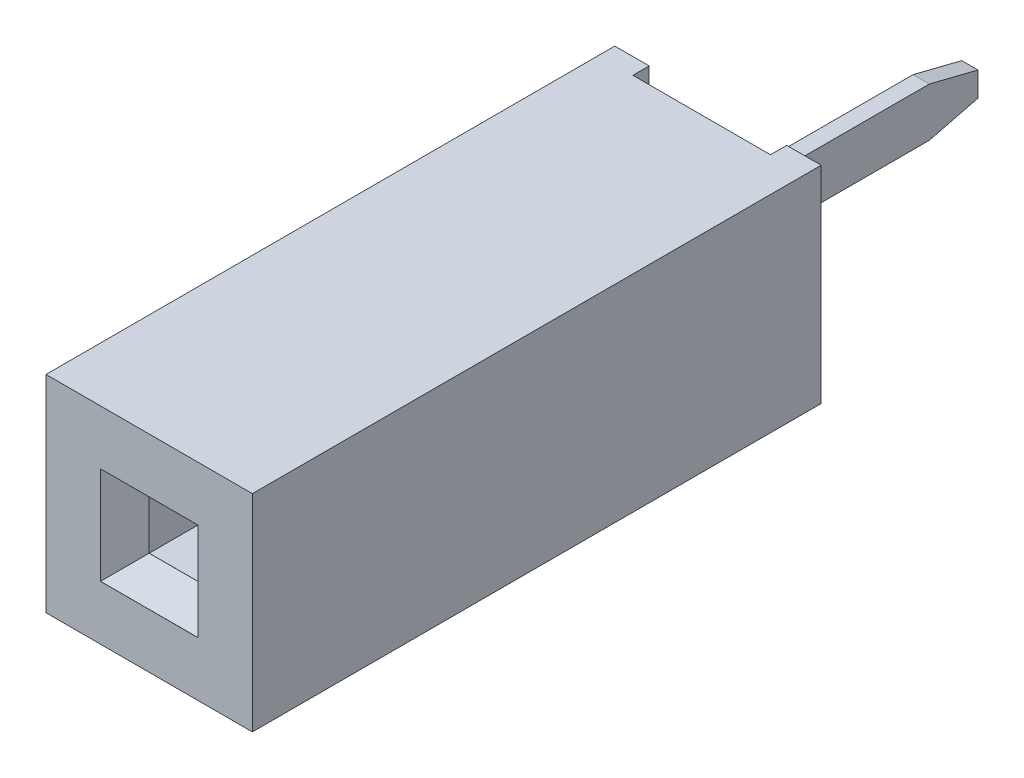
ISO-10303-21;
HEADER;
FILE_DESCRIPTION(('STEP AP214'),'2;1');
FILE_NAME('part.step','',(''),(''),'','','');
FILE_SCHEMA(('AUTOMOTIVE_DESIGN { 1 0 10303 214 1 1 1 1 }'));
ENDSEC;
DATA;
#1=APPLICATION_CONTEXT('core data for automotive mechanical design processes');
#2=APPLICATION_PROTOCOL_DEFINITION('international standard','automotive_design',2000,#1);
#3=PRODUCT_CONTEXT('',#1,'mechanical');
#4=PRODUCT('Part','Part','',(#3));
#5=PRODUCT_RELATED_PRODUCT_CATEGORY('part','',(#4));
#6=PRODUCT_DEFINITION_FORMATION('','',#4);
#7=PRODUCT_DEFINITION_CONTEXT('part definition',#1,'design');
#8=PRODUCT_DEFINITION('design','',#6,#7);
#9=PRODUCT_DEFINITION_SHAPE('','',#8);
#10=(LENGTH_UNIT() NAMED_UNIT(*) SI_UNIT(.MILLI.,.METRE.));
#11=(NAMED_UNIT(*) PLANE_ANGLE_UNIT() SI_UNIT($,.RADIAN.));
#12=(NAMED_UNIT(*) SI_UNIT($,.STERADIAN.) SOLID_ANGLE_UNIT());
#13=UNCERTAINTY_MEASURE_WITH_UNIT(LENGTH_MEASURE(1.E-05),#10,'distance_accuracy_value','');
#14=(GEOMETRIC_REPRESENTATION_CONTEXT(3) GLOBAL_UNCERTAINTY_ASSIGNED_CONTEXT((#13)) GLOBAL_UNIT_ASSIGNED_CONTEXT((#10,
#11,#12)) REPRESENTATION_CONTEXT('',''));
#15=CARTESIAN_POINT('',(0.,0.,0.));
#16=DIRECTION('',(0.,0.,1.));
#17=DIRECTION('',(1.,0.,0.));
#18=AXIS2_PLACEMENT_3D('',#15,#16,#17);
#19=CARTESIAN_POINT('',(-0.1,0.25,1.25));
#20=DIRECTION('',(0.,-1.,0.));
#21=DIRECTION('',(0.,0.,-1.));
#22=AXIS2_PLACEMENT_3D('',#19,#20,#21);
#23=PLANE('',#22);
#24=DIRECTION('',(1.,0.,0.));
#25=VECTOR('',#24,1.);
#26=CARTESIAN_POINT('',(-0.1,0.25,1.25));
#27=LINE('',#26,#25);
#28=CARTESIAN_POINT('',(-0.1,0.25,1.25));
#29=VERTEX_POINT('',#28);
#30=CARTESIAN_POINT('',(0.1,0.25,1.25));
#31=VERTEX_POINT('',#30);
#32=EDGE_CURVE('E11',#29,#31,#27,.T.);
#33=ORIENTED_EDGE('',*,*,#32,.T.);
#34=DIRECTION('',(0.,0.,1.));
#35=VECTOR('',#34,1.);
#36=CARTESIAN_POINT('',(0.1,0.25,1.25));
#37=LINE('',#36,#35);
#38=CARTESIAN_POINT('',(0.1,0.25,5.85));
#39=VERTEX_POINT('',#38);
#40=EDGE_CURVE('E482',#31,#39,#37,.T.);
#41=ORIENTED_EDGE('',*,*,#40,.T.);
#42=DIRECTION('',(1.,0.,0.));
#43=VECTOR('',#42,1.);
#44=CARTESIAN_POINT('',(-0.1,0.25,5.85));
#45=LINE('',#44,#43);
#46=CARTESIAN_POINT('',(-0.1,0.25,5.85));
#47=VERTEX_POINT('',#46);
#48=EDGE_CURVE('E362',#47,#39,#45,.T.);
#49=ORIENTED_EDGE('',*,*,#48,.F.);
#50=DIRECTION('',(0.,0.,1.));
#51=VECTOR('',#50,1.);
#52=CARTESIAN_POINT('',(-0.1,0.25,1.25));
#53=LINE('',#52,#51);
#54=EDGE_CURVE('E553',#29,#47,#53,.T.);
#55=ORIENTED_EDGE('',*,*,#54,.F.);
#56=EDGE_LOOP('',(#33,#41,#49,#55));
#57=FACE_BOUND('',#56,.T.);
#58=ADVANCED_FACE('F16',(#57),#23,.T.);
#59=CARTESIAN_POINT('',(-0.1,-0.25,1.25));
#60=DIRECTION('',(0.,0.,1.));
#61=DIRECTION('',(1.,0.,0.));
#62=AXIS2_PLACEMENT_3D('',#59,#60,#61);
#63=PLANE('',#62);
#64=DIRECTION('',(1.,0.,0.));
#65=VECTOR('',#64,1.);
#66=CARTESIAN_POINT('',(-0.1,-0.25,1.25));
#67=LINE('',#66,#65);
#68=CARTESIAN_POINT('',(-0.1,-0.25,1.25));
#69=VERTEX_POINT('',#68);
#70=CARTESIAN_POINT('',(0.1,-0.25,1.25));
#71=VERTEX_POINT('',#70);
#72=EDGE_CURVE('E27',#69,#71,#67,.T.);
#73=ORIENTED_EDGE('',*,*,#72,.T.);
#74=DIRECTION('',(0.,1.,0.));
#75=VECTOR('',#74,1.);
#76=CARTESIAN_POINT('',(0.1,-0.25,1.25));
#77=LINE('',#76,#75);
#78=EDGE_CURVE('E345',#71,#31,#77,.T.);
#79=ORIENTED_EDGE('',*,*,#78,.T.);
#80=ORIENTED_EDGE('',*,*,#32,.F.);
#81=DIRECTION('',(0.,1.,0.));
#82=VECTOR('',#81,1.);
#83=CARTESIAN_POINT('',(-0.1,-0.25,1.25));
#84=LINE('',#83,#82);
#85=EDGE_CURVE('E556',#69,#29,#84,.T.);
#86=ORIENTED_EDGE('',*,*,#85,.F.);
#87=EDGE_LOOP('',(#73,#79,#80,#86));
#88=FACE_BOUND('',#87,.T.);
#89=ADVANCED_FACE('F651',(#88),#63,.T.);
#90=CARTESIAN_POINT('',(-0.1,-0.25,5.85));
#91=DIRECTION('',(0.,1.,0.));
#92=DIRECTION('',(1.,0.,0.));
#93=AXIS2_PLACEMENT_3D('',#90,#91,#92);
#94=PLANE('',#93);
#95=DIRECTION('',(1.,0.,0.));
#96=VECTOR('',#95,1.);
#97=CARTESIAN_POINT('',(-0.1,-0.25,5.85));
#98=LINE('',#97,#96);
#99=CARTESIAN_POINT('',(-0.1,-0.25,5.85));
#100=VERTEX_POINT('',#99);
#101=CARTESIAN_POINT('',(0.1,-0.25,5.85));
#102=VERTEX_POINT('',#101);
#103=EDGE_CURVE('E480',#100,#102,#98,.T.);
#104=ORIENTED_EDGE('',*,*,#103,.T.);
#105=DIRECTION('',(0.,0.,-1.));
#106=VECTOR('',#105,1.);
#107=CARTESIAN_POINT('',(0.1,-0.25,5.85));
#108=LINE('',#107,#106);
#109=EDGE_CURVE('E341',#102,#71,#108,.T.);
#110=ORIENTED_EDGE('',*,*,#109,.T.);
#111=ORIENTED_EDGE('',*,*,#72,.F.);
#112=DIRECTION('',(0.,0.,-1.));
#113=VECTOR('',#112,1.);
#114=CARTESIAN_POINT('',(-0.1,-0.25,5.85));
#115=LINE('',#114,#113);
#116=EDGE_CURVE('E455',#100,#69,#115,.T.);
#117=ORIENTED_EDGE('',*,*,#116,.F.);
#118=EDGE_LOOP('',(#104,#110,#111,#117));
#119=FACE_BOUND('',#118,.T.);
#120=ADVANCED_FACE('F756',(#119),#94,.T.);
#121=CARTESIAN_POINT('',(-0.1,0.25,5.85));
#122=DIRECTION('',(0.,-0.707106781186548,0.707106781186548));
#123=DIRECTION('',(-1.,0.,0.));
#124=AXIS2_PLACEMENT_3D('',#121,#122,#123);
#125=PLANE('',#124);
#126=ORIENTED_EDGE('',*,*,#48,.T.);
#127=DIRECTION('',(0.,0.707106781186548,0.707106781186548));
#128=VECTOR('',#127,1.);
#129=CARTESIAN_POINT('',(0.1,0.25,5.85));
#130=LINE('',#129,#128);
#131=CARTESIAN_POINT('',(0.1,0.3,5.9));
#132=VERTEX_POINT('',#131);
#133=EDGE_CURVE('E486',#39,#132,#130,.T.);
#134=ORIENTED_EDGE('',*,*,#133,.T.);
#135=DIRECTION('',(1.,0.,0.));
#136=VECTOR('',#135,1.);
#137=CARTESIAN_POINT('',(-0.1,0.3,5.9));
#138=LINE('',#137,#136);
#139=CARTESIAN_POINT('',(-0.1,0.3,5.9));
#140=VERTEX_POINT('',#139);
#141=EDGE_CURVE('E375',#140,#132,#138,.T.);
#142=ORIENTED_EDGE('',*,*,#141,.F.);
#143=DIRECTION('',(0.,0.707106781186548,0.707106781186548));
#144=VECTOR('',#143,1.);
#145=CARTESIAN_POINT('',(-0.1,0.25,5.85));
#146=LINE('',#145,#144);
#147=EDGE_CURVE('E481',#47,#140,#146,.T.);
#148=ORIENTED_EDGE('',*,*,#147,.F.);
#149=EDGE_LOOP('',(#126,#134,#142,#148));
#150=FACE_BOUND('',#149,.T.);
#151=ADVANCED_FACE('F884',(#150),#125,.T.);
#152=CARTESIAN_POINT('',(0.3,-0.3,0.9));
#153=DIRECTION('',(0.,0.,-1.));
#154=DIRECTION('',(0.,-1.,0.));
#155=AXIS2_PLACEMENT_3D('',#152,#153,#154);
#156=PLANE('',#155);
#157=DIRECTION('',(-1.,0.,0.));
#158=VECTOR('',#157,1.);
#159=CARTESIAN_POINT('',(0.3,0.3,0.9));
#160=LINE('',#159,#158);
#161=CARTESIAN_POINT('',(0.3,0.3,0.9));
#162=VERTEX_POINT('',#161);
#163=CARTESIAN_POINT('',(0.1,0.3,0.9));
#164=VERTEX_POINT('',#163);
#165=EDGE_CURVE('E463',#162,#164,#160,.T.);
#166=ORIENTED_EDGE('',*,*,#165,.T.);
#167=DIRECTION('',(0.,1.,0.));
#168=VECTOR('',#167,1.);
#169=CARTESIAN_POINT('',(0.1,-0.3,0.9));
#170=LINE('',#169,#168);
#171=CARTESIAN_POINT('',(0.1,-0.3,0.9));
#172=VERTEX_POINT('',#171);
#173=EDGE_CURVE('E344',#172,#164,#170,.T.);
#174=ORIENTED_EDGE('',*,*,#173,.F.);
#175=DIRECTION('',(1.,0.,0.));
#176=VECTOR('',#175,1.);
#177=CARTESIAN_POINT('',(-0.3,-0.3,0.9));
#178=LINE('',#177,#176);
#179=CARTESIAN_POINT('',(0.3,-0.3,0.9));
#180=VERTEX_POINT('',#179);
#181=EDGE_CURVE('E314',#172,#180,#178,.T.);
#182=ORIENTED_EDGE('',*,*,#181,.T.);
#183=DIRECTION('',(0.,1.,0.));
#184=VECTOR('',#183,1.);
#185=CARTESIAN_POINT('',(0.3,-0.3,0.9));
#186=LINE('',#185,#184);
#187=EDGE_CURVE('E401',#180,#162,#186,.T.);
#188=ORIENTED_EDGE('',*,*,#187,.T.);
#189=EDGE_LOOP('',(#166,#174,#182,#188));
#190=FACE_BOUND('',#189,.T.);
#191=ADVANCED_FACE('F712',(#190),#156,.F.);
#192=CARTESIAN_POINT('',(0.1,0.3,0.2));
#193=DIRECTION('',(-1.,0.,0.));
#194=DIRECTION('',(0.,1.,0.));
#195=AXIS2_PLACEMENT_3D('',#192,#193,#194);
#196=PLANE('',#195);
#197=ORIENTED_EDGE('',*,*,#133,.F.);
#198=ORIENTED_EDGE('',*,*,#40,.F.);
#199=ORIENTED_EDGE('',*,*,#78,.F.);
#200=ORIENTED_EDGE('',*,*,#109,.F.);
#201=DIRECTION('',(0.,0.707106781186548,-0.707106781186548));
#202=VECTOR('',#201,1.);
#203=CARTESIAN_POINT('',(0.1,-0.3,5.9));
#204=LINE('',#203,#202);
#205=CARTESIAN_POINT('',(0.1,-0.3,5.9));
#206=VERTEX_POINT('',#205);
#207=EDGE_CURVE('E476',#206,#102,#204,.T.);
#208=ORIENTED_EDGE('',*,*,#207,.F.);
#209=DIRECTION('',(0.,0.,1.));
#210=VECTOR('',#209,1.);
#211=CARTESIAN_POINT('',(0.1,-0.3,3.45));
#212=LINE('',#211,#210);
#213=EDGE_CURVE('E493',#172,#206,#212,.T.);
#214=ORIENTED_EDGE('',*,*,#213,.F.);
#215=ORIENTED_EDGE('',*,*,#173,.T.);
#216=DIRECTION('',(0.,0.,-1.));
#217=VECTOR('',#216,1.);
#218=CARTESIAN_POINT('',(0.1,0.3,3.45));
#219=LINE('',#218,#217);
#220=EDGE_CURVE('E459',#132,#164,#219,.T.);
#221=ORIENTED_EDGE('',*,*,#220,.F.);
#222=EDGE_LOOP('',(#197,#198,#199,#200,#208,#214,#215,#221));
#223=FACE_BOUND('',#222,.T.);
#224=ADVANCED_FACE('F656',(#223),#196,.F.);
#225=CARTESIAN_POINT('',(-0.1,-0.3,5.9));
#226=DIRECTION('',(0.,0.707106781186548,0.707106781186548));
#227=DIRECTION('',(1.,0.,0.));
#228=AXIS2_PLACEMENT_3D('',#225,#226,#227);
#229=PLANE('',#228);
#230=DIRECTION('',(1.,0.,0.));
#231=VECTOR('',#230,1.);
#232=CARTESIAN_POINT('',(-0.1,-0.3,5.9));
#233=LINE('',#232,#231);
#234=CARTESIAN_POINT('',(-0.1,-0.3,5.9));
#235=VERTEX_POINT('',#234);
#236=EDGE_CURVE('E475',#235,#206,#233,.T.);
#237=ORIENTED_EDGE('',*,*,#236,.T.);
#238=ORIENTED_EDGE('',*,*,#207,.T.);
#239=ORIENTED_EDGE('',*,*,#103,.F.);
#240=DIRECTION('',(0.,0.707106781186548,-0.707106781186548));
#241=VECTOR('',#240,1.);
#242=CARTESIAN_POINT('',(-0.1,-0.3,5.9));
#243=LINE('',#242,#241);
#244=EDGE_CURVE('E400',#235,#100,#243,.T.);
#245=ORIENTED_EDGE('',*,*,#244,.F.);
#246=EDGE_LOOP('',(#237,#238,#239,#245));
#247=FACE_BOUND('',#246,.T.);
#248=ADVANCED_FACE('F753',(#247),#229,.T.);
#249=CARTESIAN_POINT('',(-0.1,0.3,0.2));
#250=DIRECTION('',(1.,0.,0.));
#251=DIRECTION('',(0.,1.,0.));
#252=AXIS2_PLACEMENT_3D('',#249,#250,#251);
#253=PLANE('',#252);
#254=DIRECTION('',(0.,0.,-1.));
#255=VECTOR('',#254,1.);
#256=CARTESIAN_POINT('',(-0.1,-0.3,3.45));
#257=LINE('',#256,#255);
#258=CARTESIAN_POINT('',(-0.1,-0.3,0.9));
#259=VERTEX_POINT('',#258);
#260=EDGE_CURVE('E470',#235,#259,#257,.T.);
#261=ORIENTED_EDGE('',*,*,#260,.F.);
#262=ORIENTED_EDGE('',*,*,#244,.T.);
#263=ORIENTED_EDGE('',*,*,#116,.T.);
#264=ORIENTED_EDGE('',*,*,#85,.T.);
#265=ORIENTED_EDGE('',*,*,#54,.T.);
#266=ORIENTED_EDGE('',*,*,#147,.T.);
#267=DIRECTION('',(0.,0.,1.));
#268=VECTOR('',#267,1.);
#269=CARTESIAN_POINT('',(-0.1,0.3,3.45));
#270=LINE('',#269,#268);
#271=CARTESIAN_POINT('',(-0.1,0.3,0.9));
#272=VERTEX_POINT('',#271);
#273=EDGE_CURVE('E371',#272,#140,#270,.T.);
#274=ORIENTED_EDGE('',*,*,#273,.F.);
#275=DIRECTION('',(0.,-1.,0.));
#276=VECTOR('',#275,1.);
#277=CARTESIAN_POINT('',(-0.1,0.3,0.9));
#278=LINE('',#277,#276);
#279=EDGE_CURVE('E397',#272,#259,#278,.T.);
#280=ORIENTED_EDGE('',*,*,#279,.T.);
#281=EDGE_LOOP('',(#261,#262,#263,#264,#265,#266,#274,#280));
#282=FACE_BOUND('',#281,.T.);
#283=ADVANCED_FACE('F743',(#282),#253,.F.);
#284=CARTESIAN_POINT('',(0.3,-0.3,0.9));
#285=DIRECTION('',(0.,0.,-1.));
#286=DIRECTION('',(0.,-1.,0.));
#287=AXIS2_PLACEMENT_3D('',#284,#285,#286);
#288=PLANE('',#287);
#289=DIRECTION('',(-1.,0.,0.));
#290=VECTOR('',#289,1.);
#291=CARTESIAN_POINT('',(0.3,0.3,0.9));
#292=LINE('',#291,#290);
#293=CARTESIAN_POINT('',(-0.3,0.3,0.9));
#294=VERTEX_POINT('',#293);
#295=EDGE_CURVE('E376',#272,#294,#292,.T.);
#296=ORIENTED_EDGE('',*,*,#295,.T.);
#297=DIRECTION('',(0.,-1.,0.));
#298=VECTOR('',#297,1.);
#299=CARTESIAN_POINT('',(-0.3,0.3,0.9));
#300=LINE('',#299,#298);
#301=CARTESIAN_POINT('',(-0.3,-0.3,0.9));
#302=VERTEX_POINT('',#301);
#303=EDGE_CURVE('E505',#294,#302,#300,.T.);
#304=ORIENTED_EDGE('',*,*,#303,.T.);
#305=DIRECTION('',(1.,0.,0.));
#306=VECTOR('',#305,1.);
#307=CARTESIAN_POINT('',(-0.3,-0.3,0.9));
#308=LINE('',#307,#306);
#309=EDGE_CURVE('E474',#302,#259,#308,.T.);
#310=ORIENTED_EDGE('',*,*,#309,.T.);
#311=ORIENTED_EDGE('',*,*,#279,.F.);
#312=EDGE_LOOP('',(#296,#304,#310,#311));
#313=FACE_BOUND('',#312,.T.);
#314=ADVANCED_FACE('F739',(#313),#288,.F.);
#315=CARTESIAN_POINT('',(0.3,-0.3,6.7));
#316=DIRECTION('',(1.,0.,0.));
#317=DIRECTION('',(0.,1.,0.));
#318=AXIS2_PLACEMENT_3D('',#315,#316,#317);
#319=PLANE('',#318);
#320=DIRECTION('',(0.,1.,0.));
#321=VECTOR('',#320,1.);
#322=CARTESIAN_POINT('',(0.3,-0.3,6.7));
#323=LINE('',#322,#321);
#324=CARTESIAN_POINT('',(0.3,-0.3,6.7));
#325=VERTEX_POINT('',#324);
#326=CARTESIAN_POINT('',(0.3,0.3,6.7));
#327=VERTEX_POINT('',#326);
#328=EDGE_CURVE('E395',#325,#327,#323,.T.);
#329=ORIENTED_EDGE('',*,*,#328,.T.);
#330=DIRECTION('',(0.,0.,-1.));
#331=VECTOR('',#330,1.);
#332=CARTESIAN_POINT('',(0.3,0.3,6.7));
#333=LINE('',#332,#331);
#334=EDGE_CURVE('E428',#327,#162,#333,.T.);
#335=ORIENTED_EDGE('',*,*,#334,.T.);
#336=ORIENTED_EDGE('',*,*,#187,.F.);
#337=DIRECTION('',(0.,0.,-1.));
#338=VECTOR('',#337,1.);
#339=CARTESIAN_POINT('',(0.3,-0.3,6.7));
#340=LINE('',#339,#338);
#341=EDGE_CURVE('E310',#325,#180,#340,.T.);
#342=ORIENTED_EDGE('',*,*,#341,.F.);
#343=EDGE_LOOP('',(#329,#335,#336,#342));
#344=FACE_BOUND('',#343,.T.);
#345=ADVANCED_FACE('F707',(#344),#319,.F.);
#346=CARTESIAN_POINT('',(0.3,0.3,6.7));
#347=DIRECTION('',(0.,-1.,0.));
#348=DIRECTION('',(0.,0.,-1.));
#349=AXIS2_PLACEMENT_3D('',#346,#347,#348);
#350=PLANE('',#349);
#351=ORIENTED_EDGE('',*,*,#334,.F.);
#352=DIRECTION('',(-1.,0.,0.));
#353=VECTOR('',#352,1.);
#354=CARTESIAN_POINT('',(0.3,0.3,6.7));
#355=LINE('',#354,#353);
#356=CARTESIAN_POINT('',(-0.3,0.3,6.7));
#357=VERTEX_POINT('',#356);
#358=EDGE_CURVE('E391',#327,#357,#355,.T.);
#359=ORIENTED_EDGE('',*,*,#358,.T.);
#360=DIRECTION('',(0.,0.,-1.));
#361=VECTOR('',#360,1.);
#362=CARTESIAN_POINT('',(-0.3,0.3,6.7));
#363=LINE('',#362,#361);
#364=EDGE_CURVE('E513',#357,#294,#363,.T.);
#365=ORIENTED_EDGE('',*,*,#364,.T.);
#366=ORIENTED_EDGE('',*,*,#295,.F.);
#367=ORIENTED_EDGE('',*,*,#273,.T.);
#368=ORIENTED_EDGE('',*,*,#141,.T.);
#369=ORIENTED_EDGE('',*,*,#220,.T.);
#370=ORIENTED_EDGE('',*,*,#165,.F.);
#371=EDGE_LOOP('',(#351,#359,#365,#366,#367,#368,#369,#370));
#372=FACE_BOUND('',#371,.T.);
#373=ADVANCED_FACE('F745',(#372),#350,.T.);
#374=CARTESIAN_POINT('',(-0.3,0.3,6.7));
#375=DIRECTION('',(-1.,0.,0.));
#376=DIRECTION('',(0.,1.,0.));
#377=AXIS2_PLACEMENT_3D('',#374,#375,#376);
#378=PLANE('',#377);
#379=DIRECTION('',(0.,-1.,0.));
#380=VECTOR('',#379,1.);
#381=CARTESIAN_POINT('',(-0.3,0.3,6.7));
#382=LINE('',#381,#380);
#383=CARTESIAN_POINT('',(-0.3,-0.3,6.7));
#384=VERTEX_POINT('',#383);
#385=EDGE_CURVE('E396',#357,#384,#382,.T.);
#386=ORIENTED_EDGE('',*,*,#385,.T.);
#387=DIRECTION('',(0.,0.,-1.));
#388=VECTOR('',#387,1.);
#389=CARTESIAN_POINT('',(-0.3,-0.3,6.7));
#390=LINE('',#389,#388);
#391=EDGE_CURVE('E315',#384,#302,#390,.T.);
#392=ORIENTED_EDGE('',*,*,#391,.T.);
#393=ORIENTED_EDGE('',*,*,#303,.F.);
#394=ORIENTED_EDGE('',*,*,#364,.F.);
#395=EDGE_LOOP('',(#386,#392,#393,#394));
#396=FACE_BOUND('',#395,.T.);
#397=ADVANCED_FACE('F748',(#396),#378,.F.);
#398=CARTESIAN_POINT('',(-0.3,-0.3,6.7));
#399=DIRECTION('',(0.,1.,0.));
#400=DIRECTION('',(1.,0.,0.));
#401=AXIS2_PLACEMENT_3D('',#398,#399,#400);
#402=PLANE('',#401);
#403=ORIENTED_EDGE('',*,*,#391,.F.);
#404=DIRECTION('',(1.,0.,0.));
#405=VECTOR('',#404,1.);
#406=CARTESIAN_POINT('',(-0.3,-0.3,6.7));
#407=LINE('',#406,#405);
#408=EDGE_CURVE('E502',#384,#325,#407,.T.);
#409=ORIENTED_EDGE('',*,*,#408,.T.);
#410=ORIENTED_EDGE('',*,*,#341,.T.);
#411=ORIENTED_EDGE('',*,*,#181,.F.);
#412=ORIENTED_EDGE('',*,*,#213,.T.);
#413=ORIENTED_EDGE('',*,*,#236,.F.);
#414=ORIENTED_EDGE('',*,*,#260,.T.);
#415=ORIENTED_EDGE('',*,*,#309,.F.);
#416=EDGE_LOOP('',(#403,#409,#410,#411,#412,#413,#414,#415));
#417=FACE_BOUND('',#416,.T.);
#418=ADVANCED_FACE('F715',(#417),#402,.T.);
#419=CARTESIAN_POINT('',(0.6,-0.6,6.7));
#420=DIRECTION('',(0.,0.,-1.));
#421=DIRECTION('',(0.,-1.,0.));
#422=AXIS2_PLACEMENT_3D('',#419,#420,#421);
#423=PLANE('',#422);
#424=ORIENTED_EDGE('',*,*,#385,.F.);
#425=ORIENTED_EDGE('',*,*,#358,.F.);
#426=ORIENTED_EDGE('',*,*,#328,.F.);
#427=ORIENTED_EDGE('',*,*,#408,.F.);
#428=EDGE_LOOP('',(#424,#425,#426,#427));
#429=FACE_BOUND('',#428,.T.);
#430=DIRECTION('',(-1.,0.,0.));
#431=VECTOR('',#430,1.);
#432=CARTESIAN_POINT('',(0.6,0.301,6.7));
#433=LINE('',#432,#431);
#434=CARTESIAN_POINT('',(0.301,0.301,6.7));
#435=VERTEX_POINT('',#434);
#436=CARTESIAN_POINT('',(-0.301,0.301,6.7));
#437=VERTEX_POINT('',#436);
#438=EDGE_CURVE('E382',#435,#437,#433,.T.);
#439=ORIENTED_EDGE('',*,*,#438,.T.);
#440=DIRECTION('',(0.,-1.,0.));
#441=VECTOR('',#440,1.);
#442=CARTESIAN_POINT('',(-0.301,0.6,6.7));
#443=LINE('',#442,#441);
#444=CARTESIAN_POINT('',(-0.301,-0.301,6.7));
#445=VERTEX_POINT('',#444);
#446=EDGE_CURVE('E326',#437,#445,#443,.T.);
#447=ORIENTED_EDGE('',*,*,#446,.T.);
#448=DIRECTION('',(1.,0.,0.));
#449=VECTOR('',#448,1.);
#450=CARTESIAN_POINT('',(-0.6,-0.301,6.7));
#451=LINE('',#450,#449);
#452=CARTESIAN_POINT('',(0.301,-0.301,6.7));
#453=VERTEX_POINT('',#452);
#454=EDGE_CURVE('E282',#445,#453,#451,.T.);
#455=ORIENTED_EDGE('',*,*,#454,.T.);
#456=DIRECTION('',(0.,1.,0.));
#457=VECTOR('',#456,1.);
#458=CARTESIAN_POINT('',(0.301,-0.6,6.7));
#459=LINE('',#458,#457);
#460=EDGE_CURVE('E381',#453,#435,#459,.T.);
#461=ORIENTED_EDGE('',*,*,#460,.T.);
#462=EDGE_LOOP('',(#439,#447,#455,#461));
#463=FACE_BOUND('',#462,.T.);
#464=ADVANCED_FACE('F722',(#429,#463),#423,.F.);
#465=CARTESIAN_POINT('',(-0.1,0.3,-2.5));
#466=DIRECTION('',(0.,0.970142500145391,-0.242535625036098));
#467=DIRECTION('',(-1.,0.,0.));
#468=AXIS2_PLACEMENT_3D('',#465,#466,#467);
#469=PLANE('',#468);
#470=DIRECTION('',(1.,0.,0.));
#471=VECTOR('',#470,1.);
#472=CARTESIAN_POINT('',(-0.1,0.3,-2.5));
#473=LINE('',#472,#471);
#474=CARTESIAN_POINT('',(-0.1,0.3,-2.5));
#475=VERTEX_POINT('',#474);
#476=CARTESIAN_POINT('',(0.1,0.3,-2.5));
#477=VERTEX_POINT('',#476);
#478=EDGE_CURVE('E329',#475,#477,#473,.T.);
#479=ORIENTED_EDGE('',*,*,#478,.T.);
#480=DIRECTION('',(0.,-0.242535625036098,-0.970142500145391));
#481=VECTOR('',#480,1.);
#482=CARTESIAN_POINT('',(0.1,0.3,-2.5));
#483=LINE('',#482,#481);
#484=CARTESIAN_POINT('',(0.1,0.15,-3.1));
#485=VERTEX_POINT('',#484);
#486=EDGE_CURVE('E406',#477,#485,#483,.T.);
#487=ORIENTED_EDGE('',*,*,#486,.T.);
#488=DIRECTION('',(1.,0.,0.));
#489=VECTOR('',#488,1.);
#490=CARTESIAN_POINT('',(-0.1,0.15,-3.1));
#491=LINE('',#490,#489);
#492=CARTESIAN_POINT('',(-0.1,0.15,-3.1));
#493=VERTEX_POINT('',#492);
#494=EDGE_CURVE('E560',#493,#485,#491,.T.);
#495=ORIENTED_EDGE('',*,*,#494,.F.);
#496=DIRECTION('',(0.,-0.242535625036098,-0.970142500145391));
#497=VECTOR('',#496,1.);
#498=CARTESIAN_POINT('',(-0.1,0.3,-2.5));
#499=LINE('',#498,#497);
#500=EDGE_CURVE('E316',#475,#493,#499,.T.);
#501=ORIENTED_EDGE('',*,*,#500,.F.);
#502=EDGE_LOOP('',(#479,#487,#495,#501));
#503=FACE_BOUND('',#502,.T.);
#504=ADVANCED_FACE('F847',(#503),#469,.T.);
#505=CARTESIAN_POINT('',(-0.1,0.15,-3.1));
#506=DIRECTION('',(0.,0.,1.));
#507=DIRECTION('',(1.,0.,0.));
#508=AXIS2_PLACEMENT_3D('',#505,#506,#507);
#509=PLANE('',#508);
#510=ORIENTED_EDGE('',*,*,#494,.T.);
#511=DIRECTION('',(0.,-1.,0.));
#512=VECTOR('',#511,1.);
#513=CARTESIAN_POINT('',(0.1,0.,-3.1));
#514=LINE('',#513,#512);
#515=CARTESIAN_POINT('',(0.1,-0.15,-3.1));
#516=VERTEX_POINT('',#515);
#517=EDGE_CURVE('E411',#485,#516,#514,.T.);
#518=ORIENTED_EDGE('',*,*,#517,.T.);
#519=DIRECTION('',(1.,0.,0.));
#520=VECTOR('',#519,1.);
#521=CARTESIAN_POINT('',(-0.1,-0.15,-3.1));
#522=LINE('',#521,#520);
#523=CARTESIAN_POINT('',(-0.1,-0.15,-3.1));
#524=VERTEX_POINT('',#523);
#525=EDGE_CURVE('E436',#524,#516,#522,.T.);
#526=ORIENTED_EDGE('',*,*,#525,.F.);
#527=DIRECTION('',(0.,-1.,0.));
#528=VECTOR('',#527,1.);
#529=CARTESIAN_POINT('',(-0.1,0.15,-3.1));
#530=LINE('',#529,#528);
#531=EDGE_CURVE('E320',#493,#524,#530,.T.);
#532=ORIENTED_EDGE('',*,*,#531,.F.);
#533=EDGE_LOOP('',(#510,#518,#526,#532));
#534=FACE_BOUND('',#533,.T.);
#535=ADVANCED_FACE('F844',(#534),#509,.F.);
#536=CARTESIAN_POINT('',(-0.1,-0.15,-3.1));
#537=DIRECTION('',(0.,-0.970142500145391,-0.242535625036098));
#538=DIRECTION('',(0.,0.242535625036098,-0.970142500145391));
#539=AXIS2_PLACEMENT_3D('',#536,#537,#538);
#540=PLANE('',#539);
#541=ORIENTED_EDGE('',*,*,#525,.T.);
#542=DIRECTION('',(0.,-0.242535625036098,0.970142500145391));
#543=VECTOR('',#542,1.);
#544=CARTESIAN_POINT('',(0.1,-0.15,-3.1));
#545=LINE('',#544,#543);
#546=CARTESIAN_POINT('',(0.1,-0.3,-2.5));
#547=VERTEX_POINT('',#546);
#548=EDGE_CURVE('E593',#516,#547,#545,.T.);
#549=ORIENTED_EDGE('',*,*,#548,.T.);
#550=DIRECTION('',(1.,0.,0.));
#551=VECTOR('',#550,1.);
#552=CARTESIAN_POINT('',(-0.1,-0.3,-2.5));
#553=LINE('',#552,#551);
#554=CARTESIAN_POINT('',(-0.1,-0.3,-2.5));
#555=VERTEX_POINT('',#554);
#556=EDGE_CURVE('E434',#555,#547,#553,.T.);
#557=ORIENTED_EDGE('',*,*,#556,.F.);
#558=DIRECTION('',(0.,-0.242535625036098,0.970142500145391));
#559=VECTOR('',#558,1.);
#560=CARTESIAN_POINT('',(-0.1,-0.15,-3.1));
#561=LINE('',#560,#559);
#562=EDGE_CURVE('E20',#524,#555,#561,.T.);
#563=ORIENTED_EDGE('',*,*,#562,.F.);
#564=EDGE_LOOP('',(#541,#549,#557,#563));
#565=FACE_BOUND('',#564,.T.);
#566=ADVANCED_FACE('F18',(#565),#540,.T.);
#567=CARTESIAN_POINT('',(-0.1,-0.3,-2.5));
#568=DIRECTION('',(0.,-1.,0.));
#569=DIRECTION('',(0.,0.,-1.));
#570=AXIS2_PLACEMENT_3D('',#567,#568,#569);
#571=PLANE('',#570);
#572=ORIENTED_EDGE('',*,*,#556,.T.);
#573=DIRECTION('',(0.,0.,1.));
#574=VECTOR('',#573,1.);
#575=CARTESIAN_POINT('',(0.1,-0.3,-2.5));
#576=LINE('',#575,#574);
#577=CARTESIAN_POINT('',(0.1,-0.3,0.2));
#578=VERTEX_POINT('',#577);
#579=EDGE_CURVE('E296',#547,#578,#576,.T.);
#580=ORIENTED_EDGE('',*,*,#579,.T.);
#581=DIRECTION('',(1.,0.,0.));
#582=VECTOR('',#581,1.);
#583=CARTESIAN_POINT('',(-0.1,-0.3,0.2));
#584=LINE('',#583,#582);
#585=CARTESIAN_POINT('',(-0.1,-0.3,0.2));
#586=VERTEX_POINT('',#585);
#587=EDGE_CURVE('E321',#586,#578,#584,.T.);
#588=ORIENTED_EDGE('',*,*,#587,.F.);
#589=DIRECTION('',(0.,0.,1.));
#590=VECTOR('',#589,1.);
#591=CARTESIAN_POINT('',(-0.1,-0.3,-2.5));
#592=LINE('',#591,#590);
#593=EDGE_CURVE('E439',#555,#586,#592,.T.);
#594=ORIENTED_EDGE('',*,*,#593,.F.);
#595=EDGE_LOOP('',(#572,#580,#588,#594));
#596=FACE_BOUND('',#595,.T.);
#597=ADVANCED_FACE('F857',(#596),#571,.T.);
#598=CARTESIAN_POINT('',(-0.1,0.3,0.2));
#599=DIRECTION('',(0.,1.,0.));
#600=DIRECTION('',(1.,0.,0.));
#601=AXIS2_PLACEMENT_3D('',#598,#599,#600);
#602=PLANE('',#601);
#603=DIRECTION('',(1.,0.,0.));
#604=VECTOR('',#603,1.);
#605=CARTESIAN_POINT('',(-0.1,0.3,0.2));
#606=LINE('',#605,#604);
#607=CARTESIAN_POINT('',(-0.1,0.3,0.2));
#608=VERTEX_POINT('',#607);
#609=CARTESIAN_POINT('',(0.1,0.3,0.2));
#610=VERTEX_POINT('',#609);
#611=EDGE_CURVE('E292',#608,#610,#606,.T.);
#612=ORIENTED_EDGE('',*,*,#611,.T.);
#613=DIRECTION('',(0.,0.,-1.));
#614=VECTOR('',#613,1.);
#615=CARTESIAN_POINT('',(0.1,0.3,0.2));
#616=LINE('',#615,#614);
#617=EDGE_CURVE('E410',#610,#477,#616,.T.);
#618=ORIENTED_EDGE('',*,*,#617,.T.);
#619=ORIENTED_EDGE('',*,*,#478,.F.);
#620=DIRECTION('',(0.,0.,-1.));
#621=VECTOR('',#620,1.);
#622=CARTESIAN_POINT('',(-0.1,0.3,0.2));
#623=LINE('',#622,#621);
#624=EDGE_CURVE('E303',#608,#475,#623,.T.);
#625=ORIENTED_EDGE('',*,*,#624,.F.);
#626=EDGE_LOOP('',(#612,#618,#619,#625));
#627=FACE_BOUND('',#626,.T.);
#628=ADVANCED_FACE('F860',(#627),#602,.T.);
#629=CARTESIAN_POINT('',(-0.4505,0.6,6.8495));
#630=DIRECTION('',(-0.707106781186548,0.,-0.707106781186548));
#631=DIRECTION('',(-0.707106781186548,0.,0.707106781186548));
#632=AXIS2_PLACEMENT_3D('',#629,#630,#631);
#633=PLANE('',#632);
#634=DIRECTION('',(0.577350269189626,-0.577350269189626,-0.577350269189626));
#635=VECTOR('',#634,1.);
#636=CARTESIAN_POINT('',(-0.300333333333,0.300333333333,6.699333333333));
#637=LINE('',#636,#635);
#638=CARTESIAN_POINT('',(-0.6,0.6,6.999));
#639=VERTEX_POINT('',#638);
#640=EDGE_CURVE('E302',#639,#437,#637,.T.);
#641=ORIENTED_EDGE('',*,*,#640,.F.);
#642=DIRECTION('',(0.,-1.,0.));
#643=VECTOR('',#642,1.);
#644=CARTESIAN_POINT('',(-0.6,0.6,6.999));
#645=LINE('',#644,#643);
#646=CARTESIAN_POINT('',(-0.6,-0.6,6.999));
#647=VERTEX_POINT('',#646);
#648=EDGE_CURVE('E297',#639,#647,#645,.T.);
#649=ORIENTED_EDGE('',*,*,#648,.T.);
#650=DIRECTION('',(0.577350269189626,0.577350269189626,-0.577350269189626));
#651=VECTOR('',#650,1.);
#652=CARTESIAN_POINT('',(-0.300333333333,-0.300333333333,6.699333333333));
#653=LINE('',#652,#651);
#654=EDGE_CURVE('E521',#647,#445,#653,.T.);
#655=ORIENTED_EDGE('',*,*,#654,.T.);
#656=ORIENTED_EDGE('',*,*,#446,.F.);
#657=EDGE_LOOP('',(#641,#649,#655,#656));
#658=FACE_BOUND('',#657,.T.);
#659=ADVANCED_FACE('F771',(#658),#633,.F.);
#660=CARTESIAN_POINT('',(-0.6,-0.4505,6.8495));
#661=DIRECTION('',(0.,-0.707106781186548,-0.707106781186548));
#662=DIRECTION('',(0.,-0.707106781186548,0.707106781186548));
#663=AXIS2_PLACEMENT_3D('',#660,#661,#662);
#664=PLANE('',#663);
#665=ORIENTED_EDGE('',*,*,#654,.F.);
#666=DIRECTION('',(1.,0.,0.));
#667=VECTOR('',#666,1.);
#668=CARTESIAN_POINT('',(-0.6,-0.6,6.999));
#669=LINE('',#668,#667);
#670=CARTESIAN_POINT('',(0.6,-0.6,6.999));
#671=VERTEX_POINT('',#670);
#672=EDGE_CURVE('E386',#647,#671,#669,.T.);
#673=ORIENTED_EDGE('',*,*,#672,.T.);
#674=DIRECTION('',(-0.577350269189626,0.577350269189626,-0.577350269189626));
#675=VECTOR('',#674,1.);
#676=CARTESIAN_POINT('',(0.300333333333,-0.300333333333,6.699333333333));
#677=LINE('',#676,#675);
#678=EDGE_CURVE('E377',#671,#453,#677,.T.);
#679=ORIENTED_EDGE('',*,*,#678,.T.);
#680=ORIENTED_EDGE('',*,*,#454,.F.);
#681=EDGE_LOOP('',(#665,#673,#679,#680));
#682=FACE_BOUND('',#681,.T.);
#683=ADVANCED_FACE('F791',(#682),#664,.F.);
#684=CARTESIAN_POINT('',(0.4505,-0.6,6.8495));
#685=DIRECTION('',(0.707106781186548,0.,-0.707106781186548));
#686=DIRECTION('',(0.,-1.,0.));
#687=AXIS2_PLACEMENT_3D('',#684,#685,#686);
#688=PLANE('',#687);
#689=ORIENTED_EDGE('',*,*,#678,.F.);
#690=DIRECTION('',(0.,1.,0.));
#691=VECTOR('',#690,1.);
#692=CARTESIAN_POINT('',(0.6,-0.6,6.999));
#693=LINE('',#692,#691);
#694=CARTESIAN_POINT('',(0.6,0.6,6.999));
#695=VERTEX_POINT('',#694);
#696=EDGE_CURVE('E335',#671,#695,#693,.T.);
#697=ORIENTED_EDGE('',*,*,#696,.T.);
#698=DIRECTION('',(-0.577350269189626,-0.577350269189626,-0.577350269189626));
#699=VECTOR('',#698,1.);
#700=CARTESIAN_POINT('',(0.300333333333,0.300333333333,6.699333333333));
#701=LINE('',#700,#699);
#702=EDGE_CURVE('E298',#695,#435,#701,.T.);
#703=ORIENTED_EDGE('',*,*,#702,.T.);
#704=ORIENTED_EDGE('',*,*,#460,.F.);
#705=EDGE_LOOP('',(#689,#697,#703,#704));
#706=FACE_BOUND('',#705,.T.);
#707=ADVANCED_FACE('F796',(#706),#688,.F.);
#708=CARTESIAN_POINT('',(0.6,0.4505,6.8495));
#709=DIRECTION('',(0.,0.707106781186548,-0.707106781186548));
#710=DIRECTION('',(-1.,0.,0.));
#711=AXIS2_PLACEMENT_3D('',#708,#709,#710);
#712=PLANE('',#711);
#713=ORIENTED_EDGE('',*,*,#702,.F.);
#714=DIRECTION('',(-1.,0.,0.));
#715=VECTOR('',#714,1.);
#716=CARTESIAN_POINT('',(0.6,0.6,6.999));
#717=LINE('',#716,#715);
#718=EDGE_CURVE('E421',#695,#639,#717,.T.);
#719=ORIENTED_EDGE('',*,*,#718,.T.);
#720=ORIENTED_EDGE('',*,*,#640,.T.);
#721=ORIENTED_EDGE('',*,*,#438,.F.);
#722=EDGE_LOOP('',(#713,#719,#720,#721));
#723=FACE_BOUND('',#722,.T.);
#724=ADVANCED_FACE('F778',(#723),#712,.F.);
#725=CARTESIAN_POINT('',(-0.1,0.3,0.2));
#726=DIRECTION('',(1.,0.,0.));
#727=DIRECTION('',(0.,1.,0.));
#728=AXIS2_PLACEMENT_3D('',#725,#726,#727);
#729=PLANE('',#728);
#730=ORIENTED_EDGE('',*,*,#500,.T.);
#731=ORIENTED_EDGE('',*,*,#531,.T.);
#732=ORIENTED_EDGE('',*,*,#562,.T.);
#733=ORIENTED_EDGE('',*,*,#593,.T.);
#734=DIRECTION('',(0.,-1.,0.));
#735=VECTOR('',#734,1.);
#736=CARTESIAN_POINT('',(-0.1,-0.485,0.2));
#737=LINE('',#736,#735);
#738=EDGE_CURVE('E532',#608,#586,#737,.T.);
#739=ORIENTED_EDGE('',*,*,#738,.F.);
#740=ORIENTED_EDGE('',*,*,#624,.T.);
#741=EDGE_LOOP('',(#730,#731,#732,#733,#739,#740));
#742=FACE_BOUND('',#741,.T.);
#743=ADVANCED_FACE('F830',(#742),#729,.F.);
#744=CARTESIAN_POINT('',(-0.1,-0.45,0.2));
#745=DIRECTION('',(0.,0.,-1.));
#746=DIRECTION('',(0.,-1.,0.));
#747=AXIS2_PLACEMENT_3D('',#744,#745,#746);
#748=PLANE('',#747);
#749=DIRECTION('',(1.,0.,0.));
#750=VECTOR('',#749,1.);
#751=CARTESIAN_POINT('',(-0.1,-0.45,0.2));
#752=LINE('',#751,#750);
#753=CARTESIAN_POINT('',(-0.1,-0.45,0.2));
#754=VERTEX_POINT('',#753);
#755=CARTESIAN_POINT('',(0.1,-0.45,0.2));
#756=VERTEX_POINT('',#755);
#757=EDGE_CURVE('E494',#754,#756,#752,.T.);
#758=ORIENTED_EDGE('',*,*,#757,.F.);
#759=DIRECTION('',(0.,-1.,0.));
#760=VECTOR('',#759,1.);
#761=CARTESIAN_POINT('',(-0.1,0.45,0.2));
#762=LINE('',#761,#760);
#763=EDGE_CURVE('E498',#586,#754,#762,.T.);
#764=ORIENTED_EDGE('',*,*,#763,.F.);
#765=ORIENTED_EDGE('',*,*,#587,.T.);
#766=DIRECTION('',(0.,-1.,0.));
#767=VECTOR('',#766,1.);
#768=CARTESIAN_POINT('',(0.1,-0.3,0.2));
#769=LINE('',#768,#767);
#770=EDGE_CURVE('E370',#578,#756,#769,.T.);
#771=ORIENTED_EDGE('',*,*,#770,.T.);
#772=EDGE_LOOP('',(#758,#764,#765,#771));
#773=FACE_BOUND('',#772,.T.);
#774=ADVANCED_FACE('F851',(#773),#748,.T.);
#775=CARTESIAN_POINT('',(0.1,0.3,0.2));
#776=DIRECTION('',(-1.,0.,0.));
#777=DIRECTION('',(0.,1.,0.));
#778=AXIS2_PLACEMENT_3D('',#775,#776,#777);
#779=PLANE('',#778);
#780=ORIENTED_EDGE('',*,*,#579,.F.);
#781=ORIENTED_EDGE('',*,*,#548,.F.);
#782=ORIENTED_EDGE('',*,*,#517,.F.);
#783=ORIENTED_EDGE('',*,*,#486,.F.);
#784=ORIENTED_EDGE('',*,*,#617,.F.);
#785=DIRECTION('',(0.,1.,0.));
#786=VECTOR('',#785,1.);
#787=CARTESIAN_POINT('',(0.1,-0.785,0.2));
#788=LINE('',#787,#786);
#789=EDGE_CURVE('E366',#578,#610,#788,.T.);
#790=ORIENTED_EDGE('',*,*,#789,.F.);
#791=EDGE_LOOP('',(#780,#781,#782,#783,#784,#790));
#792=FACE_BOUND('',#791,.T.);
#793=ADVANCED_FACE('F818',(#792),#779,.F.);
#794=CARTESIAN_POINT('',(-0.1,-0.45,0.2));
#795=DIRECTION('',(0.,0.,-1.));
#796=DIRECTION('',(0.,-1.,0.));
#797=AXIS2_PLACEMENT_3D('',#794,#795,#796);
#798=PLANE('',#797);
#799=ORIENTED_EDGE('',*,*,#611,.F.);
#800=DIRECTION('',(0.,-1.,0.));
#801=VECTOR('',#800,1.);
#802=CARTESIAN_POINT('',(-0.1,0.45,0.2));
#803=LINE('',#802,#801);
#804=CARTESIAN_POINT('',(-0.1,0.45,0.2));
#805=VERTEX_POINT('',#804);
#806=EDGE_CURVE('E536',#805,#608,#803,.T.);
#807=ORIENTED_EDGE('',*,*,#806,.F.);
#808=DIRECTION('',(1.,0.,0.));
#809=VECTOR('',#808,1.);
#810=CARTESIAN_POINT('',(-0.1,0.45,0.2));
#811=LINE('',#810,#809);
#812=CARTESIAN_POINT('',(0.1,0.45,0.2));
#813=VERTEX_POINT('',#812);
#814=EDGE_CURVE('E346',#805,#813,#811,.T.);
#815=ORIENTED_EDGE('',*,*,#814,.T.);
#816=DIRECTION('',(0.,-1.,0.));
#817=VECTOR('',#816,1.);
#818=CARTESIAN_POINT('',(0.1,-0.3,0.2));
#819=LINE('',#818,#817);
#820=EDGE_CURVE('E351',#813,#610,#819,.T.);
#821=ORIENTED_EDGE('',*,*,#820,.T.);
#822=EDGE_LOOP('',(#799,#807,#815,#821));
#823=FACE_BOUND('',#822,.T.);
#824=ADVANCED_FACE('F819',(#823),#798,.T.);
#825=CARTESIAN_POINT('',(-0.6,0.6,7.));
#826=DIRECTION('',(-1.,0.,0.));
#827=DIRECTION('',(0.,1.,0.));
#828=AXIS2_PLACEMENT_3D('',#825,#826,#827);
#829=PLANE('',#828);
#830=DIRECTION('',(0.,-1.,0.));
#831=VECTOR('',#830,1.);
#832=CARTESIAN_POINT('',(-0.6,0.6,7.));
#833=LINE('',#832,#831);
#834=CARTESIAN_POINT('',(-0.6,0.6,7.));
#835=VERTEX_POINT('',#834);
#836=CARTESIAN_POINT('',(-0.6,-0.6,7.));
#837=VERTEX_POINT('',#836);
#838=EDGE_CURVE('E330',#835,#837,#833,.T.);
#839=ORIENTED_EDGE('',*,*,#838,.T.);
#840=DIRECTION('',(0.,0.,-1.));
#841=VECTOR('',#840,1.);
#842=CARTESIAN_POINT('',(-0.6,-0.6,7.));
#843=LINE('',#842,#841);
#844=EDGE_CURVE('E325',#837,#647,#843,.T.);
#845=ORIENTED_EDGE('',*,*,#844,.T.);
#846=ORIENTED_EDGE('',*,*,#648,.F.);
#847=DIRECTION('',(0.,0.,-1.));
#848=VECTOR('',#847,1.);
#849=CARTESIAN_POINT('',(-0.6,0.6,7.));
#850=LINE('',#849,#848);
#851=EDGE_CURVE('E350',#835,#639,#850,.T.);
#852=ORIENTED_EDGE('',*,*,#851,.F.);
#853=EDGE_LOOP('',(#839,#845,#846,#852));
#854=FACE_BOUND('',#853,.T.);
#855=ADVANCED_FACE('F775',(#854),#829,.F.);
#856=CARTESIAN_POINT('',(-0.6,-0.6,7.));
#857=DIRECTION('',(0.,-1.,0.));
#858=DIRECTION('',(0.,0.,-1.));
#859=AXIS2_PLACEMENT_3D('',#856,#857,#858);
#860=PLANE('',#859);
#861=DIRECTION('',(1.,0.,0.));
#862=VECTOR('',#861,1.);
#863=CARTESIAN_POINT('',(-0.6,-0.6,7.));
#864=LINE('',#863,#862);
#865=CARTESIAN_POINT('',(0.6,-0.6,7.));
#866=VERTEX_POINT('',#865);
#867=EDGE_CURVE('E308',#837,#866,#864,.T.);
#868=ORIENTED_EDGE('',*,*,#867,.T.);
#869=DIRECTION('',(0.,0.,-1.));
#870=VECTOR('',#869,1.);
#871=CARTESIAN_POINT('',(0.6,-0.6,7.));
#872=LINE('',#871,#870);
#873=EDGE_CURVE('E339',#866,#671,#872,.T.);
#874=ORIENTED_EDGE('',*,*,#873,.T.);
#875=ORIENTED_EDGE('',*,*,#672,.F.);
#876=ORIENTED_EDGE('',*,*,#844,.F.);
#877=EDGE_LOOP('',(#868,#874,#875,#876));
#878=FACE_BOUND('',#877,.T.);
#879=ADVANCED_FACE('F788',(#878),#860,.F.);
#880=CARTESIAN_POINT('',(0.6,-0.6,7.));
#881=DIRECTION('',(1.,0.,0.));
#882=DIRECTION('',(0.,1.,0.));
#883=AXIS2_PLACEMENT_3D('',#880,#881,#882);
#884=PLANE('',#883);
#885=DIRECTION('',(0.,1.,0.));
#886=VECTOR('',#885,1.);
#887=CARTESIAN_POINT('',(0.6,-0.6,7.));
#888=LINE('',#887,#886);
#889=CARTESIAN_POINT('',(0.6,0.6,7.));
#890=VERTEX_POINT('',#889);
#891=EDGE_CURVE('E304',#866,#890,#888,.T.);
#892=ORIENTED_EDGE('',*,*,#891,.T.);
#893=DIRECTION('',(0.,0.,-1.));
#894=VECTOR('',#893,1.);
#895=CARTESIAN_POINT('',(0.6,0.6,7.));
#896=LINE('',#895,#894);
#897=EDGE_CURVE('E340',#890,#695,#896,.T.);
#898=ORIENTED_EDGE('',*,*,#897,.T.);
#899=ORIENTED_EDGE('',*,*,#696,.F.);
#900=ORIENTED_EDGE('',*,*,#873,.F.);
#901=EDGE_LOOP('',(#892,#898,#899,#900));
#902=FACE_BOUND('',#901,.T.);
#903=ADVANCED_FACE('F798',(#902),#884,.F.);
#904=CARTESIAN_POINT('',(0.6,0.6,7.));
#905=DIRECTION('',(0.,1.,0.));
#906=DIRECTION('',(1.,0.,0.));
#907=AXIS2_PLACEMENT_3D('',#904,#905,#906);
#908=PLANE('',#907);
#909=DIRECTION('',(-1.,0.,0.));
#910=VECTOR('',#909,1.);
#911=CARTESIAN_POINT('',(0.6,0.6,7.));
#912=LINE('',#911,#910);
#913=EDGE_CURVE('E334',#890,#835,#912,.T.);
#914=ORIENTED_EDGE('',*,*,#913,.T.);
#915=ORIENTED_EDGE('',*,*,#851,.T.);
#916=ORIENTED_EDGE('',*,*,#718,.F.);
#917=ORIENTED_EDGE('',*,*,#897,.F.);
#918=EDGE_LOOP('',(#914,#915,#916,#917));
#919=FACE_BOUND('',#918,.T.);
#920=ADVANCED_FACE('F780',(#919),#908,.F.);
#921=CARTESIAN_POINT('',(-1.27,1.27,0.));
#922=DIRECTION('',(1.,0.,0.));
#923=DIRECTION('',(0.,1.,0.));
#924=AXIS2_PLACEMENT_3D('',#921,#922,#923);
#925=PLANE('',#924);
#926=DIRECTION('',(0.,-1.,0.));
#927=VECTOR('',#926,1.);
#928=CARTESIAN_POINT('',(-1.27,1.27,0.));
#929=LINE('',#928,#927);
#930=CARTESIAN_POINT('',(-1.27,1.27,0.));
#931=VERTEX_POINT('',#930);
#932=CARTESIAN_POINT('',(-1.27,-1.27,0.));
#933=VERTEX_POINT('',#932);
#934=EDGE_CURVE('E286',#931,#933,#929,.T.);
#935=ORIENTED_EDGE('',*,*,#934,.T.);
#936=DIRECTION('',(0.,0.,1.));
#937=VECTOR('',#936,1.);
#938=CARTESIAN_POINT('',(-1.27,-1.27,0.));
#939=LINE('',#938,#937);
#940=CARTESIAN_POINT('',(-1.27,-1.27,7.));
#941=VERTEX_POINT('',#940);
#942=EDGE_CURVE('E285',#933,#941,#939,.T.);
#943=ORIENTED_EDGE('',*,*,#942,.T.);
#944=DIRECTION('',(0.,-1.,0.));
#945=VECTOR('',#944,1.);
#946=CARTESIAN_POINT('',(-1.27,1.27,7.));
#947=LINE('',#946,#945);
#948=CARTESIAN_POINT('',(-1.27,1.27,7.));
#949=VERTEX_POINT('',#948);
#950=EDGE_CURVE('E309',#949,#941,#947,.T.);
#951=ORIENTED_EDGE('',*,*,#950,.F.);
#952=DIRECTION('',(0.,0.,1.));
#953=VECTOR('',#952,1.);
#954=CARTESIAN_POINT('',(-1.27,1.27,0.));
#955=LINE('',#954,#953);
#956=EDGE_CURVE('E528',#931,#949,#955,.T.);
#957=ORIENTED_EDGE('',*,*,#956,.F.);
#958=EDGE_LOOP('',(#935,#943,#951,#957));
#959=FACE_BOUND('',#958,.T.);
#960=ADVANCED_FACE('F806',(#959),#925,.F.);
#961=CARTESIAN_POINT('',(0.846666666667,-1.27,0.));
#962=DIRECTION('',(-1.,0.,0.));
#963=DIRECTION('',(0.,1.,0.));
#964=AXIS2_PLACEMENT_3D('',#961,#962,#963);
#965=PLANE('',#964);
#966=DIRECTION('',(0.,0.,1.));
#967=VECTOR('',#966,1.);
#968=CARTESIAN_POINT('',(0.846666666667,-1.27,0.));
#969=LINE('',#968,#967);
#970=CARTESIAN_POINT('',(0.846666666667,-1.27,0.));
#971=VERTEX_POINT('',#970);
#972=CARTESIAN_POINT('',(0.846666666667,-1.27,0.2));
#973=VERTEX_POINT('',#972);
#974=EDGE_CURVE('E251',#971,#973,#969,.T.);
#975=ORIENTED_EDGE('',*,*,#974,.T.);
#976=DIRECTION('',(0.,1.,0.));
#977=VECTOR('',#976,1.);
#978=CARTESIAN_POINT('',(0.846666666667,-1.27,0.2));
#979=LINE('',#978,#977);
#980=CARTESIAN_POINT('',(0.846666666667,1.27,0.2));
#981=VERTEX_POINT('',#980);
#982=EDGE_CURVE('E469',#973,#981,#979,.T.);
#983=ORIENTED_EDGE('',*,*,#982,.T.);
#984=DIRECTION('',(0.,0.,1.));
#985=VECTOR('',#984,1.);
#986=CARTESIAN_POINT('',(0.846666666667,1.27,0.));
#987=LINE('',#986,#985);
#988=CARTESIAN_POINT('',(0.846666666667,1.27,0.));
#989=VERTEX_POINT('',#988);
#990=EDGE_CURVE('E390',#989,#981,#987,.T.);
#991=ORIENTED_EDGE('',*,*,#990,.F.);
#992=DIRECTION('',(0.,1.,0.));
#993=VECTOR('',#992,1.);
#994=CARTESIAN_POINT('',(0.846666666667,-1.27,0.));
#995=LINE('',#994,#993);
#996=EDGE_CURVE('E404',#971,#989,#995,.T.);
#997=ORIENTED_EDGE('',*,*,#996,.F.);
#998=EDGE_LOOP('',(#975,#983,#991,#997));
#999=FACE_BOUND('',#998,.T.);
#1000=ADVANCED_FACE('F862',(#999),#965,.T.);
#1001=CARTESIAN_POINT('',(0.846666666667,-1.27,0.2));
#1002=DIRECTION('',(0.,0.,-1.));
#1003=DIRECTION('',(0.,-1.,0.));
#1004=AXIS2_PLACEMENT_3D('',#1001,#1002,#1003);
#1005=PLANE('',#1004);
#1006=ORIENTED_EDGE('',*,*,#806,.T.);
#1007=ORIENTED_EDGE('',*,*,#738,.T.);
#1008=ORIENTED_EDGE('',*,*,#763,.T.);
#1009=ORIENTED_EDGE('',*,*,#757,.T.);
#1010=ORIENTED_EDGE('',*,*,#770,.F.);
#1011=ORIENTED_EDGE('',*,*,#789,.T.);
#1012=ORIENTED_EDGE('',*,*,#820,.F.);
#1013=ORIENTED_EDGE('',*,*,#814,.F.);
#1014=EDGE_LOOP('',(#1006,#1007,#1008,#1009,#1010,#1011,#1012,#1013));
#1015=FACE_BOUND('',#1014,.T.);
#1016=ORIENTED_EDGE('',*,*,#982,.F.);
#1017=DIRECTION('',(1.,0.,0.));
#1018=VECTOR('',#1017,1.);
#1019=CARTESIAN_POINT('',(-0.846666666667,-1.27,0.2));
#1020=LINE('',#1019,#1018);
#1021=CARTESIAN_POINT('',(-0.846666666667,-1.27,0.2));
#1022=VERTEX_POINT('',#1021);
#1023=EDGE_CURVE('E417',#1022,#973,#1020,.T.);
#1024=ORIENTED_EDGE('',*,*,#1023,.F.);
#1025=DIRECTION('',(0.,-1.,0.));
#1026=VECTOR('',#1025,1.);
#1027=CARTESIAN_POINT('',(-0.846666666667,1.27,0.2));
#1028=LINE('',#1027,#1026);
#1029=CARTESIAN_POINT('',(-0.846666666667,1.27,0.2));
#1030=VERTEX_POINT('',#1029);
#1031=EDGE_CURVE('E290',#1030,#1022,#1028,.T.);
#1032=ORIENTED_EDGE('',*,*,#1031,.F.);
#1033=DIRECTION('',(-1.,0.,0.));
#1034=VECTOR('',#1033,1.);
#1035=CARTESIAN_POINT('',(0.846666666667,1.27,0.2));
#1036=LINE('',#1035,#1034);
#1037=EDGE_CURVE('E357',#981,#1030,#1036,.T.);
#1038=ORIENTED_EDGE('',*,*,#1037,.F.);
#1039=EDGE_LOOP('',(#1016,#1024,#1032,#1038));
#1040=FACE_BOUND('',#1039,.T.);
#1041=ADVANCED_FACE('F865',(#1015,#1040),#1005,.T.);
#1042=CARTESIAN_POINT('',(-0.846666666667,1.27,0.));
#1043=DIRECTION('',(1.,0.,0.));
#1044=DIRECTION('',(0.,1.,0.));
#1045=AXIS2_PLACEMENT_3D('',#1042,#1043,#1044);
#1046=PLANE('',#1045);
#1047=DIRECTION('',(0.,0.,1.));
#1048=VECTOR('',#1047,1.);
#1049=CARTESIAN_POINT('',(-0.846666666667,1.27,0.));
#1050=LINE('',#1049,#1048);
#1051=CARTESIAN_POINT('',(-0.846666666667,1.27,0.));
#1052=VERTEX_POINT('',#1051);
#1053=EDGE_CURVE('E352',#1052,#1030,#1050,.T.);
#1054=ORIENTED_EDGE('',*,*,#1053,.T.);
#1055=ORIENTED_EDGE('',*,*,#1031,.T.);
#1056=DIRECTION('',(0.,0.,1.));
#1057=VECTOR('',#1056,1.);
#1058=CARTESIAN_POINT('',(-0.846666666667,-1.27,0.));
#1059=LINE('',#1058,#1057);
#1060=CARTESIAN_POINT('',(-0.846666666667,-1.27,0.));
#1061=VERTEX_POINT('',#1060);
#1062=EDGE_CURVE('E266',#1061,#1022,#1059,.T.);
#1063=ORIENTED_EDGE('',*,*,#1062,.F.);
#1064=DIRECTION('',(0.,-1.,0.));
#1065=VECTOR('',#1064,1.);
#1066=CARTESIAN_POINT('',(-0.846666666667,1.27,0.));
#1067=LINE('',#1066,#1065);
#1068=EDGE_CURVE('E291',#1052,#1061,#1067,.T.);
#1069=ORIENTED_EDGE('',*,*,#1068,.F.);
#1070=EDGE_LOOP('',(#1054,#1055,#1063,#1069));
#1071=FACE_BOUND('',#1070,.T.);
#1072=ADVANCED_FACE('F833',(#1071),#1046,.T.);
#1073=CARTESIAN_POINT('',(1.27,-1.27,0.));
#1074=DIRECTION('',(0.,0.,-1.));
#1075=DIRECTION('',(0.,-1.,0.));
#1076=AXIS2_PLACEMENT_3D('',#1073,#1074,#1075);
#1077=PLANE('',#1076);
#1078=ORIENTED_EDGE('',*,*,#1068,.T.);
#1079=DIRECTION('',(1.,0.,0.));
#1080=VECTOR('',#1079,1.);
#1081=CARTESIAN_POINT('',(-1.27,-1.27,0.));
#1082=LINE('',#1081,#1080);
#1083=EDGE_CURVE('E361',#933,#1061,#1082,.T.);
#1084=ORIENTED_EDGE('',*,*,#1083,.F.);
#1085=ORIENTED_EDGE('',*,*,#934,.F.);
#1086=DIRECTION('',(-1.,0.,0.));
#1087=VECTOR('',#1086,1.);
#1088=CARTESIAN_POINT('',(1.27,1.27,0.));
#1089=LINE('',#1088,#1087);
#1090=EDGE_CURVE('E356',#1052,#931,#1089,.T.);
#1091=ORIENTED_EDGE('',*,*,#1090,.F.);
#1092=EDGE_LOOP('',(#1078,#1084,#1085,#1091));
#1093=FACE_BOUND('',#1092,.T.);
#1094=ADVANCED_FACE('F831',(#1093),#1077,.T.);
#1095=CARTESIAN_POINT('',(1.27,-1.27,7.));
#1096=DIRECTION('',(0.,0.,-1.));
#1097=DIRECTION('',(0.,-1.,0.));
#1098=AXIS2_PLACEMENT_3D('',#1095,#1096,#1097);
#1099=PLANE('',#1098);
#1100=ORIENTED_EDGE('',*,*,#891,.F.);
#1101=ORIENTED_EDGE('',*,*,#867,.F.);
#1102=ORIENTED_EDGE('',*,*,#838,.F.);
#1103=ORIENTED_EDGE('',*,*,#913,.F.);
#1104=EDGE_LOOP('',(#1100,#1101,#1102,#1103));
#1105=FACE_BOUND('',#1104,.T.);
#1106=DIRECTION('',(-1.,0.,0.));
#1107=VECTOR('',#1106,1.);
#1108=CARTESIAN_POINT('',(1.27,1.27,7.));
#1109=LINE('',#1108,#1107);
#1110=CARTESIAN_POINT('',(1.27,1.27,7.));
#1111=VERTEX_POINT('',#1110);
#1112=EDGE_CURVE('E405',#1111,#949,#1109,.T.);
#1113=ORIENTED_EDGE('',*,*,#1112,.T.);
#1114=ORIENTED_EDGE('',*,*,#950,.T.);
#1115=DIRECTION('',(1.,0.,0.));
#1116=VECTOR('',#1115,1.);
#1117=CARTESIAN_POINT('',(-1.27,-1.27,7.));
#1118=LINE('',#1117,#1116);
#1119=CARTESIAN_POINT('',(1.27,-1.27,7.));
#1120=VERTEX_POINT('',#1119);
#1121=EDGE_CURVE('E256',#941,#1120,#1118,.T.);
#1122=ORIENTED_EDGE('',*,*,#1121,.T.);
#1123=DIRECTION('',(0.,1.,0.));
#1124=VECTOR('',#1123,1.);
#1125=CARTESIAN_POINT('',(1.27,-1.27,7.));
#1126=LINE('',#1125,#1124);
#1127=EDGE_CURVE('E264',#1120,#1111,#1126,.T.);
#1128=ORIENTED_EDGE('',*,*,#1127,.T.);
#1129=EDGE_LOOP('',(#1113,#1114,#1122,#1128));
#1130=FACE_BOUND('',#1129,.T.);
#1131=ADVANCED_FACE('F786',(#1105,#1130),#1099,.F.);
#1132=CARTESIAN_POINT('',(1.27,-1.27,0.));
#1133=DIRECTION('',(0.,0.,-1.));
#1134=DIRECTION('',(0.,-1.,0.));
#1135=AXIS2_PLACEMENT_3D('',#1132,#1133,#1134);
#1136=PLANE('',#1135);
#1137=DIRECTION('',(0.,1.,0.));
#1138=VECTOR('',#1137,1.);
#1139=CARTESIAN_POINT('',(1.27,-1.27,0.));
#1140=LINE('',#1139,#1138);
#1141=CARTESIAN_POINT('',(1.27,-1.27,0.));
#1142=VERTEX_POINT('',#1141);
#1143=CARTESIAN_POINT('',(1.27,1.27,0.));
#1144=VERTEX_POINT('',#1143);
#1145=EDGE_CURVE('E262',#1142,#1144,#1140,.T.);
#1146=ORIENTED_EDGE('',*,*,#1145,.F.);
#1147=DIRECTION('',(1.,0.,0.));
#1148=VECTOR('',#1147,1.);
#1149=CARTESIAN_POINT('',(-1.27,-1.27,0.));
#1150=LINE('',#1149,#1148);
#1151=EDGE_CURVE('E242',#971,#1142,#1150,.T.);
#1152=ORIENTED_EDGE('',*,*,#1151,.F.);
#1153=ORIENTED_EDGE('',*,*,#996,.T.);
#1154=DIRECTION('',(-1.,0.,0.));
#1155=VECTOR('',#1154,1.);
#1156=CARTESIAN_POINT('',(1.27,1.27,0.));
#1157=LINE('',#1156,#1155);
#1158=EDGE_CURVE('E270',#1144,#989,#1157,.T.);
#1159=ORIENTED_EDGE('',*,*,#1158,.F.);
#1160=EDGE_LOOP('',(#1146,#1152,#1153,#1159));
#1161=FACE_BOUND('',#1160,.T.);
#1162=ADVANCED_FACE('F268',(#1161),#1136,.T.);
#1163=CARTESIAN_POINT('',(1.27,1.27,0.));
#1164=DIRECTION('',(0.,-1.,0.));
#1165=DIRECTION('',(0.,0.,-1.));
#1166=AXIS2_PLACEMENT_3D('',#1163,#1164,#1165);
#1167=PLANE('',#1166);
#1168=ORIENTED_EDGE('',*,*,#990,.T.);
#1169=ORIENTED_EDGE('',*,*,#1037,.T.);
#1170=ORIENTED_EDGE('',*,*,#1053,.F.);
#1171=ORIENTED_EDGE('',*,*,#1090,.T.);
#1172=ORIENTED_EDGE('',*,*,#956,.T.);
#1173=ORIENTED_EDGE('',*,*,#1112,.F.);
#1174=DIRECTION('',(0.,0.,1.));
#1175=VECTOR('',#1174,1.);
#1176=CARTESIAN_POINT('',(1.27,1.27,0.));
#1177=LINE('',#1176,#1175);
#1178=EDGE_CURVE('E273',#1144,#1111,#1177,.T.);
#1179=ORIENTED_EDGE('',*,*,#1178,.F.);
#1180=ORIENTED_EDGE('',*,*,#1158,.T.);
#1181=EDGE_LOOP('',(#1168,#1169,#1170,#1171,#1172,#1173,#1179,#1180));
#1182=FACE_BOUND('',#1181,.T.);
#1183=ADVANCED_FACE('F825',(#1182),#1167,.F.);
#1184=CARTESIAN_POINT('',(-1.27,-1.27,0.));
#1185=DIRECTION('',(0.,1.,0.));
#1186=DIRECTION('',(1.,0.,0.));
#1187=AXIS2_PLACEMENT_3D('',#1184,#1185,#1186);
#1188=PLANE('',#1187);
#1189=ORIENTED_EDGE('',*,*,#1062,.T.);
#1190=ORIENTED_EDGE('',*,*,#1023,.T.);
#1191=ORIENTED_EDGE('',*,*,#974,.F.);
#1192=ORIENTED_EDGE('',*,*,#1151,.T.);
#1193=DIRECTION('',(0.,0.,1.));
#1194=VECTOR('',#1193,1.);
#1195=CARTESIAN_POINT('',(1.27,-1.27,0.));
#1196=LINE('',#1195,#1194);
#1197=EDGE_CURVE('E247',#1142,#1120,#1196,.T.);
#1198=ORIENTED_EDGE('',*,*,#1197,.T.);
#1199=ORIENTED_EDGE('',*,*,#1121,.F.);
#1200=ORIENTED_EDGE('',*,*,#942,.F.);
#1201=ORIENTED_EDGE('',*,*,#1083,.T.);
#1202=EDGE_LOOP('',(#1189,#1190,#1191,#1192,#1198,#1199,#1200,#1201));
#1203=FACE_BOUND('',#1202,.T.);
#1204=ADVANCED_FACE('F245',(#1203),#1188,.F.);
#1205=CARTESIAN_POINT('',(1.27,-1.27,0.));
#1206=DIRECTION('',(-1.,0.,0.));
#1207=DIRECTION('',(0.,1.,0.));
#1208=AXIS2_PLACEMENT_3D('',#1205,#1206,#1207);
#1209=PLANE('',#1208);
#1210=ORIENTED_EDGE('',*,*,#1145,.T.);
#1211=ORIENTED_EDGE('',*,*,#1178,.T.);
#1212=ORIENTED_EDGE('',*,*,#1127,.F.);
#1213=ORIENTED_EDGE('',*,*,#1197,.F.);
#1214=EDGE_LOOP('',(#1210,#1211,#1212,#1213));
#1215=FACE_BOUND('',#1214,.T.);
#1216=ADVANCED_FACE('F260',(#1215),#1209,.F.);
#1217=CLOSED_SHELL('',(#58,#89,#120,#151,#191,#224,#248,#283,#314,#345,#373,#397,#418,#464,#504,
#535,#566,#597,#628,#659,#683,#707,#724,#743,#774,#793,#824,#855,#879,#903,#920,#960,#1000,
#1041,#1072,#1094,#1131,#1162,#1183,#1204,#1216));
#1218=MANIFOLD_SOLID_BREP('B1',#1217);
#1219=ADVANCED_BREP_SHAPE_REPRESENTATION('',(#18,#1218),#14);
#1220=SHAPE_DEFINITION_REPRESENTATION(#9,#1219);
ENDSEC;
END-ISO-10303-21;
